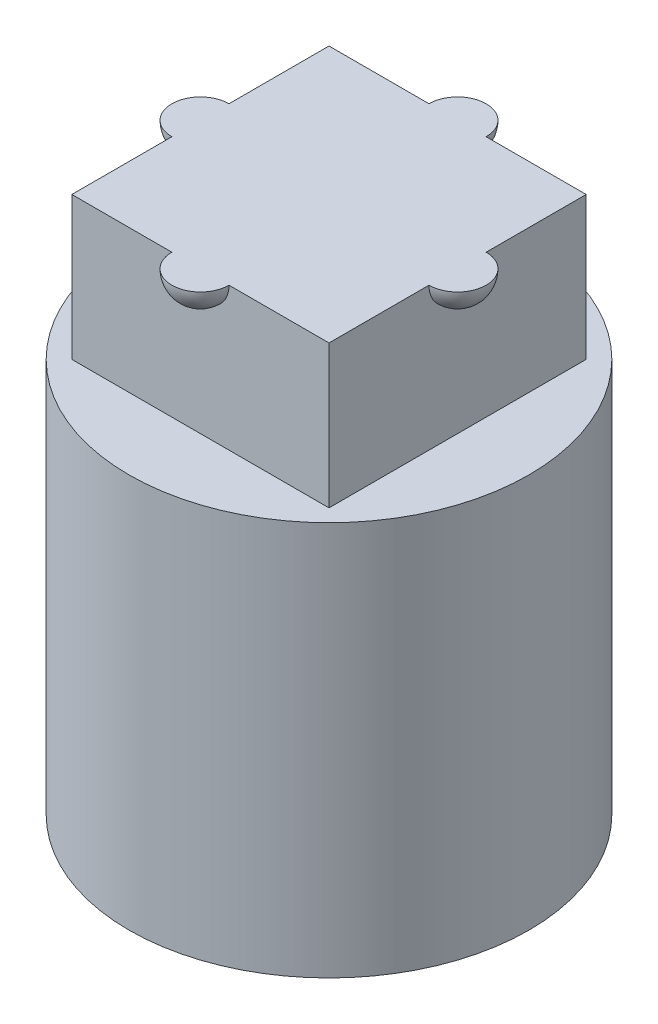
ISO-10303-21;
HEADER;
FILE_DESCRIPTION(('STEP AP214'),'2;1');
FILE_NAME('part.step','',(''),(''),'','','');
FILE_SCHEMA(('AUTOMOTIVE_DESIGN { 1 0 10303 214 1 1 1 1 }'));
ENDSEC;
DATA;
#1=APPLICATION_CONTEXT('core data for automotive mechanical design processes');
#2=APPLICATION_PROTOCOL_DEFINITION('international standard','automotive_design',2000,#1);
#3=PRODUCT_CONTEXT('',#1,'mechanical');
#4=PRODUCT('Part','Part','',(#3));
#5=PRODUCT_RELATED_PRODUCT_CATEGORY('part','',(#4));
#6=PRODUCT_DEFINITION_FORMATION('','',#4);
#7=PRODUCT_DEFINITION_CONTEXT('part definition',#1,'design');
#8=PRODUCT_DEFINITION('design','',#6,#7);
#9=PRODUCT_DEFINITION_SHAPE('','',#8);
#10=(LENGTH_UNIT() NAMED_UNIT(*) SI_UNIT(.MILLI.,.METRE.));
#11=(NAMED_UNIT(*) PLANE_ANGLE_UNIT() SI_UNIT($,.RADIAN.));
#12=(NAMED_UNIT(*) SI_UNIT($,.STERADIAN.) SOLID_ANGLE_UNIT());
#13=UNCERTAINTY_MEASURE_WITH_UNIT(LENGTH_MEASURE(1.E-05),#10,'distance_accuracy_value','');
#14=(GEOMETRIC_REPRESENTATION_CONTEXT(3) GLOBAL_UNCERTAINTY_ASSIGNED_CONTEXT((#13)) GLOBAL_UNIT_ASSIGNED_CONTEXT((#10,
#11,#12)) REPRESENTATION_CONTEXT('',''));
#15=CARTESIAN_POINT('',(0.,0.,0.));
#16=DIRECTION('',(0.,0.,1.));
#17=DIRECTION('',(1.,0.,0.));
#18=AXIS2_PLACEMENT_3D('',#15,#16,#17);
#19=CARTESIAN_POINT('',(2.25,9.4,0.));
#20=DIRECTION('',(-1.,0.,0.));
#21=DIRECTION('',(0.,0.,1.));
#22=AXIS2_PLACEMENT_3D('',#19,#20,#21);
#23=SPHERICAL_SURFACE('',#22,0.5);
#24=CARTESIAN_POINT('',(2.25,9.4,0.));
#25=DIRECTION('',(-1.,0.,0.));
#26=DIRECTION('',(0.,0.,1.));
#27=AXIS2_PLACEMENT_3D('',#24,#25,#26);
#28=CIRCLE('',#27,0.5);
#29=CARTESIAN_POINT('',(2.25,9.4,-0.5));
#30=VERTEX_POINT('',#29);
#31=CARTESIAN_POINT('',(2.25,9.4,0.5));
#32=VERTEX_POINT('',#31);
#33=EDGE_CURVE('E197',#30,#32,#28,.T.);
#34=ORIENTED_EDGE('',*,*,#33,.F.);
#35=CARTESIAN_POINT('',(2.25,9.4,0.));
#36=DIRECTION('',(0.,1.,0.));
#37=DIRECTION('',(0.,0.,1.));
#38=AXIS2_PLACEMENT_3D('',#35,#36,#37);
#39=CIRCLE('',#38,0.5);
#40=EDGE_CURVE('E588',#30,#32,#39,.F.);
#41=ORIENTED_EDGE('',*,*,#40,.T.);
#42=EDGE_LOOP('',(#34,#41));
#43=FACE_BOUND('',#42,.T.);
#44=ADVANCED_FACE('F35',(#43),#23,.T.);
#45=CARTESIAN_POINT('',(-2.25,9.4,0.));
#46=DIRECTION('',(-1.,0.,0.));
#47=DIRECTION('',(0.,0.,1.));
#48=AXIS2_PLACEMENT_3D('',#45,#46,#47);
#49=SPHERICAL_SURFACE('',#48,0.5);
#50=CARTESIAN_POINT('',(-2.25,9.4,0.));
#51=DIRECTION('',(1.,0.,0.));
#52=DIRECTION('',(0.,0.,-1.));
#53=AXIS2_PLACEMENT_3D('',#50,#51,#52);
#54=CIRCLE('',#53,0.5);
#55=CARTESIAN_POINT('',(-2.25,9.4,0.5));
#56=VERTEX_POINT('',#55);
#57=CARTESIAN_POINT('',(-2.25,9.4,-0.5));
#58=VERTEX_POINT('',#57);
#59=EDGE_CURVE('E595',#56,#58,#54,.T.);
#60=ORIENTED_EDGE('',*,*,#59,.F.);
#61=CARTESIAN_POINT('',(-2.25,9.4,0.));
#62=DIRECTION('',(0.,1.,0.));
#63=DIRECTION('',(0.,0.,1.));
#64=AXIS2_PLACEMENT_3D('',#61,#62,#63);
#65=CIRCLE('',#64,0.5);
#66=EDGE_CURVE('E57',#56,#58,#65,.F.);
#67=ORIENTED_EDGE('',*,*,#66,.T.);
#68=EDGE_LOOP('',(#60,#67));
#69=FACE_BOUND('',#68,.T.);
#70=ADVANCED_FACE('F379',(#69),#49,.T.);
#71=CARTESIAN_POINT('',(0.,9.4,-2.25));
#72=DIRECTION('',(0.,0.,1.));
#73=DIRECTION('',(1.,0.,0.));
#74=AXIS2_PLACEMENT_3D('',#71,#72,#73);
#75=SPHERICAL_SURFACE('',#74,0.5);
#76=CARTESIAN_POINT('',(0.,9.4,-2.25));
#77=DIRECTION('',(0.,1.,0.));
#78=DIRECTION('',(0.,0.,1.));
#79=AXIS2_PLACEMENT_3D('',#76,#77,#78);
#80=CIRCLE('',#79,0.5);
#81=CARTESIAN_POINT('',(0.499999999999999,9.4,-2.25));
#82=VERTEX_POINT('',#81);
#83=CARTESIAN_POINT('',(-0.500000000000001,9.4,-2.25));
#84=VERTEX_POINT('',#83);
#85=EDGE_CURVE('E50',#82,#84,#80,.T.);
#86=ORIENTED_EDGE('',*,*,#85,.F.);
#87=CARTESIAN_POINT('',(0.,9.4,-2.25));
#88=DIRECTION('',(0.,0.,1.));
#89=DIRECTION('',(1.,0.,0.));
#90=AXIS2_PLACEMENT_3D('',#87,#88,#89);
#91=CIRCLE('',#90,0.5);
#92=EDGE_CURVE('E181',#82,#84,#91,.F.);
#93=ORIENTED_EDGE('',*,*,#92,.T.);
#94=EDGE_LOOP('',(#86,#93));
#95=FACE_BOUND('',#94,.T.);
#96=ADVANCED_FACE('F385',(#95),#75,.T.);
#97=CARTESIAN_POINT('',(0.,9.4,2.25));
#98=DIRECTION('',(0.,0.,1.));
#99=DIRECTION('',(1.,0.,0.));
#100=AXIS2_PLACEMENT_3D('',#97,#98,#99);
#101=SPHERICAL_SURFACE('',#100,0.5);
#102=CARTESIAN_POINT('',(0.,9.4,2.25));
#103=DIRECTION('',(0.,1.,0.));
#104=DIRECTION('',(0.,0.,1.));
#105=AXIS2_PLACEMENT_3D('',#102,#103,#104);
#106=CIRCLE('',#105,0.5);
#107=CARTESIAN_POINT('',(-0.500000000000001,9.4,2.25));
#108=VERTEX_POINT('',#107);
#109=CARTESIAN_POINT('',(0.499999999999999,9.4,2.25));
#110=VERTEX_POINT('',#109);
#111=EDGE_CURVE('E11',#108,#110,#106,.T.);
#112=ORIENTED_EDGE('',*,*,#111,.F.);
#113=CARTESIAN_POINT('',(0.,9.4,2.25));
#114=DIRECTION('',(0.,0.,-1.));
#115=DIRECTION('',(-1.,0.,0.));
#116=AXIS2_PLACEMENT_3D('',#113,#114,#115);
#117=CIRCLE('',#116,0.5);
#118=EDGE_CURVE('E178',#108,#110,#117,.F.);
#119=ORIENTED_EDGE('',*,*,#118,.T.);
#120=EDGE_LOOP('',(#112,#119));
#121=FACE_BOUND('',#120,.T.);
#122=ADVANCED_FACE('F179',(#121),#101,.T.);
#123=CARTESIAN_POINT('',(0.,6.9,0.));
#124=DIRECTION('',(0.,1.,0.));
#125=DIRECTION('',(0.,0.,1.));
#126=AXIS2_PLACEMENT_3D('',#123,#124,#125);
#127=PLANE('',#126);
#128=CARTESIAN_POINT('',(0.,6.9,0.));
#129=DIRECTION('',(0.,1.,0.));
#130=DIRECTION('',(0.,0.,1.));
#131=AXIS2_PLACEMENT_3D('',#128,#129,#130);
#132=CIRCLE('',#131,3.5);
#133=CARTESIAN_POINT('',(0.,6.9,3.5));
#134=VERTEX_POINT('',#133);
#135=EDGE_CURVE('E213',#134,#134,#132,.T.);
#136=ORIENTED_EDGE('',*,*,#135,.T.);
#137=EDGE_LOOP('',(#136));
#138=FACE_BOUND('',#137,.T.);
#139=DIRECTION('',(-1.,0.,0.));
#140=VECTOR('',#139,1.);
#141=CARTESIAN_POINT('',(-2.25,6.9,-2.25));
#142=LINE('',#141,#140);
#143=CARTESIAN_POINT('',(2.25,6.9,-2.25));
#144=VERTEX_POINT('',#143);
#145=CARTESIAN_POINT('',(-2.25,6.9,-2.25));
#146=VERTEX_POINT('',#145);
#147=EDGE_CURVE('E196',#144,#146,#142,.T.);
#148=ORIENTED_EDGE('',*,*,#147,.F.);
#149=DIRECTION('',(0.,0.,-1.));
#150=VECTOR('',#149,1.);
#151=CARTESIAN_POINT('',(2.25,6.9,-2.25));
#152=LINE('',#151,#150);
#153=CARTESIAN_POINT('',(2.25,6.9,2.25));
#154=VERTEX_POINT('',#153);
#155=EDGE_CURVE('E193',#154,#144,#152,.T.);
#156=ORIENTED_EDGE('',*,*,#155,.F.);
#157=DIRECTION('',(1.,0.,0.));
#158=VECTOR('',#157,1.);
#159=CARTESIAN_POINT('',(-2.25,6.9,2.25));
#160=LINE('',#159,#158);
#161=CARTESIAN_POINT('',(-2.25,6.9,2.25));
#162=VERTEX_POINT('',#161);
#163=EDGE_CURVE('E202',#162,#154,#160,.T.);
#164=ORIENTED_EDGE('',*,*,#163,.F.);
#165=DIRECTION('',(0.,0.,1.));
#166=VECTOR('',#165,1.);
#167=CARTESIAN_POINT('',(-2.25,6.9,-2.25));
#168=LINE('',#167,#166);
#169=EDGE_CURVE('E199',#146,#162,#168,.T.);
#170=ORIENTED_EDGE('',*,*,#169,.F.);
#171=EDGE_LOOP('',(#148,#156,#164,#170));
#172=FACE_BOUND('',#171,.T.);
#173=ADVANCED_FACE('F321',(#138,#172),#127,.T.);
#174=CARTESIAN_POINT('',(0.,0.,0.));
#175=DIRECTION('',(0.,1.,0.));
#176=DIRECTION('',(0.,0.,1.));
#177=AXIS2_PLACEMENT_3D('',#174,#175,#176);
#178=PLANE('',#177);
#179=CARTESIAN_POINT('',(0.,0.,0.));
#180=DIRECTION('',(0.,1.,0.));
#181=DIRECTION('',(0.,0.,1.));
#182=AXIS2_PLACEMENT_3D('',#179,#180,#181);
#183=CIRCLE('',#182,3.5);
#184=CARTESIAN_POINT('',(0.,0.,3.5));
#185=VERTEX_POINT('',#184);
#186=EDGE_CURVE('E43',#185,#185,#183,.T.);
#187=ORIENTED_EDGE('',*,*,#186,.F.);
#188=EDGE_LOOP('',(#187));
#189=FACE_BOUND('',#188,.T.);
#190=DIRECTION('',(0.,0.,-1.));
#191=VECTOR('',#190,1.);
#192=CARTESIAN_POINT('',(2.25,0.,0.400000000000001));
#193=LINE('',#192,#191);
#194=CARTESIAN_POINT('',(2.25,0.,2.25));
#195=VERTEX_POINT('',#194);
#196=CARTESIAN_POINT('',(2.25,0.,0.400000000000001));
#197=VERTEX_POINT('',#196);
#198=EDGE_CURVE('E216',#195,#197,#193,.T.);
#199=ORIENTED_EDGE('',*,*,#198,.T.);
#200=CARTESIAN_POINT('',(2.25,0.,0.));
#201=DIRECTION('',(0.,1.,0.));
#202=DIRECTION('',(0.,0.,1.));
#203=AXIS2_PLACEMENT_3D('',#200,#201,#202);
#204=CIRCLE('',#203,0.4);
#205=CARTESIAN_POINT('',(2.25,0.,-0.4));
#206=VERTEX_POINT('',#205);
#207=EDGE_CURVE('E257',#197,#206,#204,.T.);
#208=ORIENTED_EDGE('',*,*,#207,.T.);
#209=DIRECTION('',(0.,0.,-1.));
#210=VECTOR('',#209,1.);
#211=CARTESIAN_POINT('',(2.25,0.,-2.25));
#212=LINE('',#211,#210);
#213=CARTESIAN_POINT('',(2.25,0.,-2.25));
#214=VERTEX_POINT('',#213);
#215=EDGE_CURVE('E260',#206,#214,#212,.T.);
#216=ORIENTED_EDGE('',*,*,#215,.T.);
#217=DIRECTION('',(-1.,0.,0.));
#218=VECTOR('',#217,1.);
#219=CARTESIAN_POINT('',(0.4,0.,-2.25));
#220=LINE('',#219,#218);
#221=CARTESIAN_POINT('',(0.4,0.,-2.25));
#222=VERTEX_POINT('',#221);
#223=EDGE_CURVE('E263',#214,#222,#220,.T.);
#224=ORIENTED_EDGE('',*,*,#223,.T.);
#225=CARTESIAN_POINT('',(0.,0.,-2.25));
#226=DIRECTION('',(0.,1.,0.));
#227=DIRECTION('',(0.,0.,1.));
#228=AXIS2_PLACEMENT_3D('',#225,#226,#227);
#229=CIRCLE('',#228,0.4);
#230=CARTESIAN_POINT('',(-0.4,0.,-2.25));
#231=VERTEX_POINT('',#230);
#232=EDGE_CURVE('E266',#222,#231,#229,.T.);
#233=ORIENTED_EDGE('',*,*,#232,.T.);
#234=DIRECTION('',(-1.,0.,0.));
#235=VECTOR('',#234,1.);
#236=CARTESIAN_POINT('',(-2.25,0.,-2.25));
#237=LINE('',#236,#235);
#238=CARTESIAN_POINT('',(-2.25,0.,-2.25));
#239=VERTEX_POINT('',#238);
#240=EDGE_CURVE('E269',#231,#239,#237,.T.);
#241=ORIENTED_EDGE('',*,*,#240,.T.);
#242=DIRECTION('',(0.,0.,1.));
#243=VECTOR('',#242,1.);
#244=CARTESIAN_POINT('',(-2.25,0.,-2.25));
#245=LINE('',#244,#243);
#246=CARTESIAN_POINT('',(-2.25,0.,-0.4));
#247=VERTEX_POINT('',#246);
#248=EDGE_CURVE('E272',#239,#247,#245,.T.);
#249=ORIENTED_EDGE('',*,*,#248,.T.);
#250=CARTESIAN_POINT('',(-2.25,0.,0.));
#251=DIRECTION('',(0.,1.,0.));
#252=DIRECTION('',(0.,0.,1.));
#253=AXIS2_PLACEMENT_3D('',#250,#251,#252);
#254=CIRCLE('',#253,0.4);
#255=CARTESIAN_POINT('',(-2.25,0.,0.4));
#256=VERTEX_POINT('',#255);
#257=EDGE_CURVE('E275',#247,#256,#254,.T.);
#258=ORIENTED_EDGE('',*,*,#257,.T.);
#259=DIRECTION('',(0.,0.,1.));
#260=VECTOR('',#259,1.);
#261=CARTESIAN_POINT('',(-2.25,0.,0.4));
#262=LINE('',#261,#260);
#263=CARTESIAN_POINT('',(-2.25,0.,2.25));
#264=VERTEX_POINT('',#263);
#265=EDGE_CURVE('E278',#256,#264,#262,.T.);
#266=ORIENTED_EDGE('',*,*,#265,.T.);
#267=DIRECTION('',(1.,0.,0.));
#268=VECTOR('',#267,1.);
#269=CARTESIAN_POINT('',(-2.25,0.,2.25));
#270=LINE('',#269,#268);
#271=CARTESIAN_POINT('',(-0.399999999999984,0.,2.25));
#272=VERTEX_POINT('',#271);
#273=EDGE_CURVE('E281',#264,#272,#270,.T.);
#274=ORIENTED_EDGE('',*,*,#273,.T.);
#275=CARTESIAN_POINT('',(0.,0.,2.25));
#276=DIRECTION('',(0.,1.,0.));
#277=DIRECTION('',(0.,0.,1.));
#278=AXIS2_PLACEMENT_3D('',#275,#276,#277);
#279=CIRCLE('',#278,0.4);
#280=CARTESIAN_POINT('',(0.400000000000016,0.,2.25));
#281=VERTEX_POINT('',#280);
#282=EDGE_CURVE('E284',#272,#281,#279,.T.);
#283=ORIENTED_EDGE('',*,*,#282,.T.);
#284=DIRECTION('',(1.,0.,0.));
#285=VECTOR('',#284,1.);
#286=CARTESIAN_POINT('',(0.400000000000016,0.,2.25));
#287=LINE('',#286,#285);
#288=EDGE_CURVE('E221',#281,#195,#287,.T.);
#289=ORIENTED_EDGE('',*,*,#288,.T.);
#290=EDGE_LOOP('',(#199,#208,#216,#224,#233,#241,#249,#258,#266,#274,#283,#289));
#291=FACE_BOUND('',#290,.T.);
#292=ADVANCED_FACE('F318',(#189,#291),#178,.F.);
#293=CARTESIAN_POINT('',(0.,4.,0.));
#294=DIRECTION('',(0.,-1.,0.));
#295=DIRECTION('',(0.,0.,-1.));
#296=AXIS2_PLACEMENT_3D('',#293,#294,#295);
#297=CYLINDRICAL_SURFACE('',#296,3.5);
#298=ORIENTED_EDGE('',*,*,#186,.T.);
#299=EDGE_LOOP('',(#298));
#300=FACE_BOUND('',#299,.T.);
#301=ORIENTED_EDGE('',*,*,#135,.F.);
#302=EDGE_LOOP('',(#301));
#303=FACE_BOUND('',#302,.T.);
#304=ADVANCED_FACE('F37',(#300,#303),#297,.T.);
#305=CARTESIAN_POINT('',(2.25,4.,0.400000000000001));
#306=DIRECTION('',(-1.,0.,0.));
#307=DIRECTION('',(0.,0.,1.));
#308=AXIS2_PLACEMENT_3D('',#305,#306,#307);
#309=PLANE('',#308);
#310=ORIENTED_EDGE('',*,*,#198,.F.);
#311=DIRECTION('',(0.,-1.,0.));
#312=VECTOR('',#311,1.);
#313=CARTESIAN_POINT('',(2.25,4.,2.25));
#314=LINE('',#313,#312);
#315=CARTESIAN_POINT('',(2.25,4.,2.25));
#316=VERTEX_POINT('',#315);
#317=EDGE_CURVE('E254',#316,#195,#314,.T.);
#318=ORIENTED_EDGE('',*,*,#317,.F.);
#319=DIRECTION('',(0.,0.,-1.));
#320=VECTOR('',#319,1.);
#321=CARTESIAN_POINT('',(2.25,4.,0.400000000000001));
#322=LINE('',#321,#320);
#323=CARTESIAN_POINT('',(2.25,4.,0.400000000000001));
#324=VERTEX_POINT('',#323);
#325=EDGE_CURVE('E217',#316,#324,#322,.T.);
#326=ORIENTED_EDGE('',*,*,#325,.T.);
#327=DIRECTION('',(0.,-1.,0.));
#328=VECTOR('',#327,1.);
#329=CARTESIAN_POINT('',(2.25,4.,0.400000000000001));
#330=LINE('',#329,#328);
#331=EDGE_CURVE('E311',#324,#197,#330,.T.);
#332=ORIENTED_EDGE('',*,*,#331,.T.);
#333=EDGE_LOOP('',(#310,#318,#326,#332));
#334=FACE_BOUND('',#333,.T.);
#335=ADVANCED_FACE('F325',(#334),#309,.T.);
#336=CARTESIAN_POINT('',(2.25,4.,0.));
#337=DIRECTION('',(0.,-1.,0.));
#338=DIRECTION('',(0.,0.,-1.));
#339=AXIS2_PLACEMENT_3D('',#336,#337,#338);
#340=CYLINDRICAL_SURFACE('',#339,0.4);
#341=ORIENTED_EDGE('',*,*,#207,.F.);
#342=ORIENTED_EDGE('',*,*,#331,.F.);
#343=CARTESIAN_POINT('',(2.25,4.,0.));
#344=DIRECTION('',(0.,1.,0.));
#345=DIRECTION('',(0.,0.,1.));
#346=AXIS2_PLACEMENT_3D('',#343,#344,#345);
#347=CIRCLE('',#346,0.4);
#348=CARTESIAN_POINT('',(2.25,4.,-0.4));
#349=VERTEX_POINT('',#348);
#350=EDGE_CURVE('E220',#324,#349,#347,.T.);
#351=ORIENTED_EDGE('',*,*,#350,.T.);
#352=DIRECTION('',(0.,-1.,0.));
#353=VECTOR('',#352,1.);
#354=CARTESIAN_POINT('',(2.25,4.,-0.4));
#355=LINE('',#354,#353);
#356=EDGE_CURVE('E309',#349,#206,#355,.T.);
#357=ORIENTED_EDGE('',*,*,#356,.T.);
#358=EDGE_LOOP('',(#341,#342,#351,#357));
#359=FACE_BOUND('',#358,.T.);
#360=ADVANCED_FACE('F333',(#359),#340,.F.);
#361=CARTESIAN_POINT('',(2.25,4.,-2.25));
#362=DIRECTION('',(-1.,0.,0.));
#363=DIRECTION('',(0.,0.,1.));
#364=AXIS2_PLACEMENT_3D('',#361,#362,#363);
#365=PLANE('',#364);
#366=ORIENTED_EDGE('',*,*,#215,.F.);
#367=ORIENTED_EDGE('',*,*,#356,.F.);
#368=DIRECTION('',(0.,0.,-1.));
#369=VECTOR('',#368,1.);
#370=CARTESIAN_POINT('',(2.25,4.,-2.25));
#371=LINE('',#370,#369);
#372=CARTESIAN_POINT('',(2.25,4.,-2.25));
#373=VERTEX_POINT('',#372);
#374=EDGE_CURVE('E224',#349,#373,#371,.T.);
#375=ORIENTED_EDGE('',*,*,#374,.T.);
#376=DIRECTION('',(0.,-1.,0.));
#377=VECTOR('',#376,1.);
#378=CARTESIAN_POINT('',(2.25,4.,-2.25));
#379=LINE('',#378,#377);
#380=EDGE_CURVE('E307',#373,#214,#379,.T.);
#381=ORIENTED_EDGE('',*,*,#380,.T.);
#382=EDGE_LOOP('',(#366,#367,#375,#381));
#383=FACE_BOUND('',#382,.T.);
#384=ADVANCED_FACE('F337',(#383),#365,.T.);
#385=CARTESIAN_POINT('',(0.4,4.,-2.25));
#386=DIRECTION('',(0.,0.,1.));
#387=DIRECTION('',(1.,0.,0.));
#388=AXIS2_PLACEMENT_3D('',#385,#386,#387);
#389=PLANE('',#388);
#390=ORIENTED_EDGE('',*,*,#223,.F.);
#391=ORIENTED_EDGE('',*,*,#380,.F.);
#392=DIRECTION('',(-1.,0.,0.));
#393=VECTOR('',#392,1.);
#394=CARTESIAN_POINT('',(0.4,4.,-2.25));
#395=LINE('',#394,#393);
#396=CARTESIAN_POINT('',(0.4,4.,-2.25));
#397=VERTEX_POINT('',#396);
#398=EDGE_CURVE('E227',#373,#397,#395,.T.);
#399=ORIENTED_EDGE('',*,*,#398,.T.);
#400=DIRECTION('',(0.,-1.,0.));
#401=VECTOR('',#400,1.);
#402=CARTESIAN_POINT('',(0.4,4.,-2.25));
#403=LINE('',#402,#401);
#404=EDGE_CURVE('E305',#397,#222,#403,.T.);
#405=ORIENTED_EDGE('',*,*,#404,.T.);
#406=EDGE_LOOP('',(#390,#391,#399,#405));
#407=FACE_BOUND('',#406,.T.);
#408=ADVANCED_FACE('F342',(#407),#389,.T.);
#409=CARTESIAN_POINT('',(0.,4.,-2.25));
#410=DIRECTION('',(0.,-1.,0.));
#411=DIRECTION('',(0.,0.,-1.));
#412=AXIS2_PLACEMENT_3D('',#409,#410,#411);
#413=CYLINDRICAL_SURFACE('',#412,0.4);
#414=ORIENTED_EDGE('',*,*,#232,.F.);
#415=ORIENTED_EDGE('',*,*,#404,.F.);
#416=CARTESIAN_POINT('',(0.,4.,-2.25));
#417=DIRECTION('',(0.,1.,0.));
#418=DIRECTION('',(0.,0.,1.));
#419=AXIS2_PLACEMENT_3D('',#416,#417,#418);
#420=CIRCLE('',#419,0.4);
#421=CARTESIAN_POINT('',(-0.4,4.,-2.25));
#422=VERTEX_POINT('',#421);
#423=EDGE_CURVE('E230',#397,#422,#420,.T.);
#424=ORIENTED_EDGE('',*,*,#423,.T.);
#425=DIRECTION('',(0.,-1.,0.));
#426=VECTOR('',#425,1.);
#427=CARTESIAN_POINT('',(-0.4,4.,-2.25));
#428=LINE('',#427,#426);
#429=EDGE_CURVE('E303',#422,#231,#428,.T.);
#430=ORIENTED_EDGE('',*,*,#429,.T.);
#431=EDGE_LOOP('',(#414,#415,#424,#430));
#432=FACE_BOUND('',#431,.T.);
#433=ADVANCED_FACE('F345',(#432),#413,.F.);
#434=CARTESIAN_POINT('',(-2.25,4.,-2.25));
#435=DIRECTION('',(0.,0.,1.));
#436=DIRECTION('',(1.,0.,0.));
#437=AXIS2_PLACEMENT_3D('',#434,#435,#436);
#438=PLANE('',#437);
#439=ORIENTED_EDGE('',*,*,#240,.F.);
#440=ORIENTED_EDGE('',*,*,#429,.F.);
#441=DIRECTION('',(-1.,0.,0.));
#442=VECTOR('',#441,1.);
#443=CARTESIAN_POINT('',(-2.25,4.,-2.25));
#444=LINE('',#443,#442);
#445=CARTESIAN_POINT('',(-2.25,4.,-2.25));
#446=VERTEX_POINT('',#445);
#447=EDGE_CURVE('E233',#422,#446,#444,.T.);
#448=ORIENTED_EDGE('',*,*,#447,.T.);
#449=DIRECTION('',(0.,-1.,0.));
#450=VECTOR('',#449,1.);
#451=CARTESIAN_POINT('',(-2.25,4.,-2.25));
#452=LINE('',#451,#450);
#453=EDGE_CURVE('E301',#446,#239,#452,.T.);
#454=ORIENTED_EDGE('',*,*,#453,.T.);
#455=EDGE_LOOP('',(#439,#440,#448,#454));
#456=FACE_BOUND('',#455,.T.);
#457=ADVANCED_FACE('F349',(#456),#438,.T.);
#458=CARTESIAN_POINT('',(-2.25,4.,-2.25));
#459=DIRECTION('',(1.,0.,0.));
#460=DIRECTION('',(0.,0.,-1.));
#461=AXIS2_PLACEMENT_3D('',#458,#459,#460);
#462=PLANE('',#461);
#463=ORIENTED_EDGE('',*,*,#248,.F.);
#464=ORIENTED_EDGE('',*,*,#453,.F.);
#465=DIRECTION('',(0.,0.,1.));
#466=VECTOR('',#465,1.);
#467=CARTESIAN_POINT('',(-2.25,4.,-2.25));
#468=LINE('',#467,#466);
#469=CARTESIAN_POINT('',(-2.25,4.,-0.4));
#470=VERTEX_POINT('',#469);
#471=EDGE_CURVE('E236',#446,#470,#468,.T.);
#472=ORIENTED_EDGE('',*,*,#471,.T.);
#473=DIRECTION('',(0.,-1.,0.));
#474=VECTOR('',#473,1.);
#475=CARTESIAN_POINT('',(-2.25,4.,-0.4));
#476=LINE('',#475,#474);
#477=EDGE_CURVE('E299',#470,#247,#476,.T.);
#478=ORIENTED_EDGE('',*,*,#477,.T.);
#479=EDGE_LOOP('',(#463,#464,#472,#478));
#480=FACE_BOUND('',#479,.T.);
#481=ADVANCED_FACE('F354',(#480),#462,.T.);
#482=CARTESIAN_POINT('',(-2.25,4.,0.));
#483=DIRECTION('',(0.,-1.,0.));
#484=DIRECTION('',(0.,0.,-1.));
#485=AXIS2_PLACEMENT_3D('',#482,#483,#484);
#486=CYLINDRICAL_SURFACE('',#485,0.4);
#487=ORIENTED_EDGE('',*,*,#257,.F.);
#488=ORIENTED_EDGE('',*,*,#477,.F.);
#489=CARTESIAN_POINT('',(-2.25,4.,0.));
#490=DIRECTION('',(0.,1.,0.));
#491=DIRECTION('',(0.,0.,1.));
#492=AXIS2_PLACEMENT_3D('',#489,#490,#491);
#493=CIRCLE('',#492,0.4);
#494=CARTESIAN_POINT('',(-2.25,4.,0.4));
#495=VERTEX_POINT('',#494);
#496=EDGE_CURVE('E239',#470,#495,#493,.T.);
#497=ORIENTED_EDGE('',*,*,#496,.T.);
#498=DIRECTION('',(0.,-1.,0.));
#499=VECTOR('',#498,1.);
#500=CARTESIAN_POINT('',(-2.25,4.,0.4));
#501=LINE('',#500,#499);
#502=EDGE_CURVE('E297',#495,#256,#501,.T.);
#503=ORIENTED_EDGE('',*,*,#502,.T.);
#504=EDGE_LOOP('',(#487,#488,#497,#503));
#505=FACE_BOUND('',#504,.T.);
#506=ADVANCED_FACE('F357',(#505),#486,.F.);
#507=CARTESIAN_POINT('',(-2.25,4.,0.4));
#508=DIRECTION('',(1.,0.,0.));
#509=DIRECTION('',(0.,0.,-1.));
#510=AXIS2_PLACEMENT_3D('',#507,#508,#509);
#511=PLANE('',#510);
#512=ORIENTED_EDGE('',*,*,#265,.F.);
#513=ORIENTED_EDGE('',*,*,#502,.F.);
#514=DIRECTION('',(0.,0.,1.));
#515=VECTOR('',#514,1.);
#516=CARTESIAN_POINT('',(-2.25,4.,0.4));
#517=LINE('',#516,#515);
#518=CARTESIAN_POINT('',(-2.25,4.,2.25));
#519=VERTEX_POINT('',#518);
#520=EDGE_CURVE('E242',#495,#519,#517,.T.);
#521=ORIENTED_EDGE('',*,*,#520,.T.);
#522=DIRECTION('',(0.,-1.,0.));
#523=VECTOR('',#522,1.);
#524=CARTESIAN_POINT('',(-2.25,4.,2.25));
#525=LINE('',#524,#523);
#526=EDGE_CURVE('E295',#519,#264,#525,.T.);
#527=ORIENTED_EDGE('',*,*,#526,.T.);
#528=EDGE_LOOP('',(#512,#513,#521,#527));
#529=FACE_BOUND('',#528,.T.);
#530=ADVANCED_FACE('F361',(#529),#511,.T.);
#531=CARTESIAN_POINT('',(-2.25,4.,2.25));
#532=DIRECTION('',(0.,0.,-1.));
#533=DIRECTION('',(-1.,0.,0.));
#534=AXIS2_PLACEMENT_3D('',#531,#532,#533);
#535=PLANE('',#534);
#536=ORIENTED_EDGE('',*,*,#273,.F.);
#537=ORIENTED_EDGE('',*,*,#526,.F.);
#538=DIRECTION('',(1.,0.,0.));
#539=VECTOR('',#538,1.);
#540=CARTESIAN_POINT('',(-2.25,4.,2.25));
#541=LINE('',#540,#539);
#542=CARTESIAN_POINT('',(-0.399999999999984,4.,2.25));
#543=VERTEX_POINT('',#542);
#544=EDGE_CURVE('E245',#519,#543,#541,.T.);
#545=ORIENTED_EDGE('',*,*,#544,.T.);
#546=DIRECTION('',(0.,-1.,0.));
#547=VECTOR('',#546,1.);
#548=CARTESIAN_POINT('',(-0.399999999999984,4.,2.25));
#549=LINE('',#548,#547);
#550=EDGE_CURVE('E293',#543,#272,#549,.T.);
#551=ORIENTED_EDGE('',*,*,#550,.T.);
#552=EDGE_LOOP('',(#536,#537,#545,#551));
#553=FACE_BOUND('',#552,.T.);
#554=ADVANCED_FACE('F366',(#553),#535,.T.);
#555=CARTESIAN_POINT('',(0.,4.,2.25));
#556=DIRECTION('',(0.,-1.,0.));
#557=DIRECTION('',(0.,0.,-1.));
#558=AXIS2_PLACEMENT_3D('',#555,#556,#557);
#559=CYLINDRICAL_SURFACE('',#558,0.4);
#560=ORIENTED_EDGE('',*,*,#282,.F.);
#561=ORIENTED_EDGE('',*,*,#550,.F.);
#562=CARTESIAN_POINT('',(0.,4.,2.25));
#563=DIRECTION('',(0.,1.,0.));
#564=DIRECTION('',(0.,0.,1.));
#565=AXIS2_PLACEMENT_3D('',#562,#563,#564);
#566=CIRCLE('',#565,0.4);
#567=CARTESIAN_POINT('',(0.400000000000016,4.,2.25));
#568=VERTEX_POINT('',#567);
#569=EDGE_CURVE('E248',#543,#568,#566,.T.);
#570=ORIENTED_EDGE('',*,*,#569,.T.);
#571=DIRECTION('',(0.,-1.,0.));
#572=VECTOR('',#571,1.);
#573=CARTESIAN_POINT('',(0.400000000000016,4.,2.25));
#574=LINE('',#573,#572);
#575=EDGE_CURVE('E291',#568,#281,#574,.T.);
#576=ORIENTED_EDGE('',*,*,#575,.T.);
#577=EDGE_LOOP('',(#560,#561,#570,#576));
#578=FACE_BOUND('',#577,.T.);
#579=ADVANCED_FACE('F369',(#578),#559,.F.);
#580=CARTESIAN_POINT('',(0.400000000000016,4.,2.25));
#581=DIRECTION('',(0.,0.,-1.));
#582=DIRECTION('',(-1.,0.,0.));
#583=AXIS2_PLACEMENT_3D('',#580,#581,#582);
#584=PLANE('',#583);
#585=ORIENTED_EDGE('',*,*,#288,.F.);
#586=ORIENTED_EDGE('',*,*,#575,.F.);
#587=DIRECTION('',(1.,0.,0.));
#588=VECTOR('',#587,1.);
#589=CARTESIAN_POINT('',(0.400000000000016,4.,2.25));
#590=LINE('',#589,#588);
#591=EDGE_CURVE('E251',#568,#316,#590,.T.);
#592=ORIENTED_EDGE('',*,*,#591,.T.);
#593=ORIENTED_EDGE('',*,*,#317,.T.);
#594=EDGE_LOOP('',(#585,#586,#592,#593));
#595=FACE_BOUND('',#594,.T.);
#596=ADVANCED_FACE('F328',(#595),#584,.T.);
#597=CARTESIAN_POINT('',(0.,4.,0.));
#598=DIRECTION('',(0.,1.,0.));
#599=DIRECTION('',(0.,0.,1.));
#600=AXIS2_PLACEMENT_3D('',#597,#598,#599);
#601=PLANE('',#600);
#602=ORIENTED_EDGE('',*,*,#325,.F.);
#603=ORIENTED_EDGE('',*,*,#591,.F.);
#604=ORIENTED_EDGE('',*,*,#569,.F.);
#605=ORIENTED_EDGE('',*,*,#544,.F.);
#606=ORIENTED_EDGE('',*,*,#520,.F.);
#607=ORIENTED_EDGE('',*,*,#496,.F.);
#608=ORIENTED_EDGE('',*,*,#471,.F.);
#609=ORIENTED_EDGE('',*,*,#447,.F.);
#610=ORIENTED_EDGE('',*,*,#423,.F.);
#611=ORIENTED_EDGE('',*,*,#398,.F.);
#612=ORIENTED_EDGE('',*,*,#374,.F.);
#613=ORIENTED_EDGE('',*,*,#350,.F.);
#614=EDGE_LOOP('',(#602,#603,#604,#605,#606,#607,#608,#609,#610,#611,#612,#613));
#615=FACE_BOUND('',#614,.T.);
#616=ADVANCED_FACE('F331',(#615),#601,.F.);
#617=CARTESIAN_POINT('',(2.25,9.4,-2.25));
#618=DIRECTION('',(-1.,0.,0.));
#619=DIRECTION('',(0.,0.,1.));
#620=AXIS2_PLACEMENT_3D('',#617,#618,#619);
#621=PLANE('',#620);
#622=DIRECTION('',(0.,0.,-1.));
#623=VECTOR('',#622,1.);
#624=CARTESIAN_POINT('',(2.25,9.4,-2.25));
#625=LINE('',#624,#623);
#626=CARTESIAN_POINT('',(2.25,9.4,-2.25));
#627=VERTEX_POINT('',#626);
#628=EDGE_CURVE('E204',#30,#627,#625,.T.);
#629=ORIENTED_EDGE('',*,*,#628,.F.);
#630=ORIENTED_EDGE('',*,*,#33,.T.);
#631=CARTESIAN_POINT('',(2.25,9.4,2.25));
#632=VERTEX_POINT('',#631);
#633=EDGE_CURVE('E598',#632,#32,#625,.T.);
#634=ORIENTED_EDGE('',*,*,#633,.F.);
#635=DIRECTION('',(0.,-1.,0.));
#636=VECTOR('',#635,1.);
#637=CARTESIAN_POINT('',(2.25,9.4,2.25));
#638=LINE('',#637,#636);
#639=EDGE_CURVE('E185',#632,#154,#638,.T.);
#640=ORIENTED_EDGE('',*,*,#639,.T.);
#641=ORIENTED_EDGE('',*,*,#155,.T.);
#642=DIRECTION('',(0.,-1.,0.));
#643=VECTOR('',#642,1.);
#644=CARTESIAN_POINT('',(2.25,9.4,-2.25));
#645=LINE('',#644,#643);
#646=EDGE_CURVE('E211',#627,#144,#645,.T.);
#647=ORIENTED_EDGE('',*,*,#646,.F.);
#648=EDGE_LOOP('',(#629,#630,#634,#640,#641,#647));
#649=FACE_BOUND('',#648,.T.);
#650=ADVANCED_FACE('F402',(#649),#621,.F.);
#651=CARTESIAN_POINT('',(-2.25,9.4,-2.25));
#652=DIRECTION('',(0.,0.,1.));
#653=DIRECTION('',(1.,0.,0.));
#654=AXIS2_PLACEMENT_3D('',#651,#652,#653);
#655=PLANE('',#654);
#656=ORIENTED_EDGE('',*,*,#92,.F.);
#657=DIRECTION('',(-1.,0.,0.));
#658=VECTOR('',#657,1.);
#659=CARTESIAN_POINT('',(-2.25,9.4,-2.25));
#660=LINE('',#659,#658);
#661=EDGE_CURVE('E591',#627,#82,#660,.T.);
#662=ORIENTED_EDGE('',*,*,#661,.F.);
#663=ORIENTED_EDGE('',*,*,#646,.T.);
#664=ORIENTED_EDGE('',*,*,#147,.T.);
#665=DIRECTION('',(0.,-1.,0.));
#666=VECTOR('',#665,1.);
#667=CARTESIAN_POINT('',(-2.25,9.4,-2.25));
#668=LINE('',#667,#666);
#669=CARTESIAN_POINT('',(-2.25,9.4,-2.25));
#670=VERTEX_POINT('',#669);
#671=EDGE_CURVE('E208',#670,#146,#668,.T.);
#672=ORIENTED_EDGE('',*,*,#671,.F.);
#673=EDGE_CURVE('E594',#84,#670,#660,.T.);
#674=ORIENTED_EDGE('',*,*,#673,.F.);
#675=EDGE_LOOP('',(#656,#662,#663,#664,#672,#674));
#676=FACE_BOUND('',#675,.T.);
#677=ADVANCED_FACE('F398',(#676),#655,.F.);
#678=CARTESIAN_POINT('',(-2.25,9.4,-2.25));
#679=DIRECTION('',(1.,0.,0.));
#680=DIRECTION('',(0.,0.,-1.));
#681=AXIS2_PLACEMENT_3D('',#678,#679,#680);
#682=PLANE('',#681);
#683=DIRECTION('',(0.,0.,1.));
#684=VECTOR('',#683,1.);
#685=CARTESIAN_POINT('',(-2.25,9.4,-2.25));
#686=LINE('',#685,#684);
#687=CARTESIAN_POINT('',(-2.25,9.4,2.25));
#688=VERTEX_POINT('',#687);
#689=EDGE_CURVE('E189',#56,#688,#686,.T.);
#690=ORIENTED_EDGE('',*,*,#689,.F.);
#691=ORIENTED_EDGE('',*,*,#59,.T.);
#692=EDGE_CURVE('E187',#670,#58,#686,.T.);
#693=ORIENTED_EDGE('',*,*,#692,.F.);
#694=ORIENTED_EDGE('',*,*,#671,.T.);
#695=ORIENTED_EDGE('',*,*,#169,.T.);
#696=DIRECTION('',(0.,-1.,0.));
#697=VECTOR('',#696,1.);
#698=CARTESIAN_POINT('',(-2.25,9.4,2.25));
#699=LINE('',#698,#697);
#700=EDGE_CURVE('E206',#688,#162,#699,.T.);
#701=ORIENTED_EDGE('',*,*,#700,.F.);
#702=EDGE_LOOP('',(#690,#691,#693,#694,#695,#701));
#703=FACE_BOUND('',#702,.T.);
#704=ADVANCED_FACE('F395',(#703),#682,.F.);
#705=CARTESIAN_POINT('',(-2.25,9.4,2.25));
#706=DIRECTION('',(0.,0.,-1.));
#707=DIRECTION('',(-1.,0.,0.));
#708=AXIS2_PLACEMENT_3D('',#705,#706,#707);
#709=PLANE('',#708);
#710=ORIENTED_EDGE('',*,*,#118,.F.);
#711=DIRECTION('',(1.,0.,0.));
#712=VECTOR('',#711,1.);
#713=CARTESIAN_POINT('',(-2.25,9.4,2.25));
#714=LINE('',#713,#712);
#715=EDGE_CURVE('E175',#688,#108,#714,.T.);
#716=ORIENTED_EDGE('',*,*,#715,.F.);
#717=ORIENTED_EDGE('',*,*,#700,.T.);
#718=ORIENTED_EDGE('',*,*,#163,.T.);
#719=ORIENTED_EDGE('',*,*,#639,.F.);
#720=EDGE_CURVE('E172',#110,#632,#714,.T.);
#721=ORIENTED_EDGE('',*,*,#720,.F.);
#722=EDGE_LOOP('',(#710,#716,#717,#718,#719,#721));
#723=FACE_BOUND('',#722,.T.);
#724=ADVANCED_FACE('F183',(#723),#709,.F.);
#725=CARTESIAN_POINT('',(0.,9.4,0.));
#726=DIRECTION('',(0.,1.,0.));
#727=DIRECTION('',(0.,0.,1.));
#728=AXIS2_PLACEMENT_3D('',#725,#726,#727);
#729=PLANE('',#728);
#730=ORIENTED_EDGE('',*,*,#715,.T.);
#731=ORIENTED_EDGE('',*,*,#111,.T.);
#732=ORIENTED_EDGE('',*,*,#720,.T.);
#733=ORIENTED_EDGE('',*,*,#633,.T.);
#734=ORIENTED_EDGE('',*,*,#40,.F.);
#735=ORIENTED_EDGE('',*,*,#628,.T.);
#736=ORIENTED_EDGE('',*,*,#661,.T.);
#737=ORIENTED_EDGE('',*,*,#85,.T.);
#738=ORIENTED_EDGE('',*,*,#673,.T.);
#739=ORIENTED_EDGE('',*,*,#692,.T.);
#740=ORIENTED_EDGE('',*,*,#66,.F.);
#741=ORIENTED_EDGE('',*,*,#689,.T.);
#742=EDGE_LOOP('',(#730,#731,#732,#733,#734,#735,#736,#737,#738,#739,#740,#741));
#743=FACE_BOUND('',#742,.T.);
#744=ADVANCED_FACE('F169',(#743),#729,.T.);
#745=CLOSED_SHELL('',(#44,#70,#96,#122,#173,#292,#304,#335,#360,#384,#408,#433,#457,#481,#506,
#530,#554,#579,#596,#616,#650,#677,#704,#724,#744));
#746=MANIFOLD_SOLID_BREP('B2',#745);
#747=ADVANCED_BREP_SHAPE_REPRESENTATION('',(#18,#746),#14);
#748=SHAPE_DEFINITION_REPRESENTATION(#9,#747);
ENDSEC;
END-ISO-10303-21;
